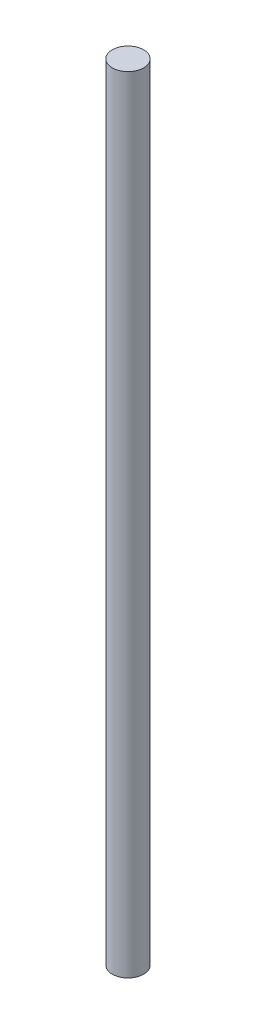
ISO-10303-21;
HEADER;
FILE_DESCRIPTION(('STEP AP214'),'2;1');
FILE_NAME('part.step','',(''),(''),'','','');
FILE_SCHEMA(('AUTOMOTIVE_DESIGN { 1 0 10303 214 1 1 1 1 }'));
ENDSEC;
DATA;
#1=APPLICATION_CONTEXT('core data for automotive mechanical design processes');
#2=APPLICATION_PROTOCOL_DEFINITION('international standard','automotive_design',2000,#1);
#3=PRODUCT_CONTEXT('',#1,'mechanical');
#4=PRODUCT('Part','Part','',(#3));
#5=PRODUCT_RELATED_PRODUCT_CATEGORY('part','',(#4));
#6=PRODUCT_DEFINITION_FORMATION('','',#4);
#7=PRODUCT_DEFINITION_CONTEXT('part definition',#1,'design');
#8=PRODUCT_DEFINITION('design','',#6,#7);
#9=PRODUCT_DEFINITION_SHAPE('','',#8);
#10=(LENGTH_UNIT() NAMED_UNIT(*) SI_UNIT(.MILLI.,.METRE.));
#11=(NAMED_UNIT(*) PLANE_ANGLE_UNIT() SI_UNIT($,.RADIAN.));
#12=(NAMED_UNIT(*) SI_UNIT($,.STERADIAN.) SOLID_ANGLE_UNIT());
#13=UNCERTAINTY_MEASURE_WITH_UNIT(LENGTH_MEASURE(1.E-05),#10,'distance_accuracy_value','');
#14=(GEOMETRIC_REPRESENTATION_CONTEXT(3) GLOBAL_UNCERTAINTY_ASSIGNED_CONTEXT((#13)) GLOBAL_UNIT_ASSIGNED_CONTEXT((#10,
#11,#12)) REPRESENTATION_CONTEXT('',''));
#15=CARTESIAN_POINT('',(0.,0.,0.));
#16=DIRECTION('',(0.,0.,1.));
#17=DIRECTION('',(1.,0.,0.));
#18=AXIS2_PLACEMENT_3D('',#15,#16,#17);
#19=CARTESIAN_POINT('',(0.,200.,0.));
#20=DIRECTION('',(0.,-1.,0.));
#21=DIRECTION('',(0.,0.,-1.));
#22=AXIS2_PLACEMENT_3D('',#19,#20,#21);
#23=CYLINDRICAL_SURFACE('',#22,4.);
#24=CARTESIAN_POINT('',(0.,200.,0.));
#25=DIRECTION('',(0.,1.,0.));
#26=DIRECTION('',(0.,0.,1.));
#27=AXIS2_PLACEMENT_3D('',#24,#25,#26);
#28=CIRCLE('',#27,4.);
#29=CARTESIAN_POINT('',(0.,200.,4.));
#30=VERTEX_POINT('',#29);
#31=EDGE_CURVE('E10',#30,#30,#28,.T.);
#32=ORIENTED_EDGE('',*,*,#31,.F.);
#33=EDGE_LOOP('',(#32));
#34=FACE_BOUND('',#33,.T.);
#35=CARTESIAN_POINT('',(0.,0.,0.));
#36=DIRECTION('',(0.,1.,0.));
#37=DIRECTION('',(0.,0.,1.));
#38=AXIS2_PLACEMENT_3D('',#35,#36,#37);
#39=CIRCLE('',#38,4.);
#40=CARTESIAN_POINT('',(0.,0.,4.));
#41=VERTEX_POINT('',#40);
#42=EDGE_CURVE('E39',#41,#41,#39,.T.);
#43=ORIENTED_EDGE('',*,*,#42,.T.);
#44=EDGE_LOOP('',(#43));
#45=FACE_BOUND('',#44,.T.);
#46=ADVANCED_FACE('F36',(#34,#45),#23,.T.);
#47=CARTESIAN_POINT('',(0.,200.,0.));
#48=DIRECTION('',(0.,1.,0.));
#49=DIRECTION('',(0.,0.,1.));
#50=AXIS2_PLACEMENT_3D('',#47,#48,#49);
#51=PLANE('',#50);
#52=ORIENTED_EDGE('',*,*,#31,.T.);
#53=EDGE_LOOP('',(#52));
#54=FACE_BOUND('',#53,.T.);
#55=ADVANCED_FACE('F51',(#54),#51,.T.);
#56=CARTESIAN_POINT('',(0.,0.,0.));
#57=DIRECTION('',(0.,1.,0.));
#58=DIRECTION('',(0.,0.,1.));
#59=AXIS2_PLACEMENT_3D('',#56,#57,#58);
#60=PLANE('',#59);
#61=ORIENTED_EDGE('',*,*,#42,.F.);
#62=EDGE_LOOP('',(#61));
#63=FACE_BOUND('',#62,.T.);
#64=ADVANCED_FACE('F49',(#63),#60,.F.);
#65=CLOSED_SHELL('',(#46,#55,#64));
#66=MANIFOLD_SOLID_BREP('B2',#65);
#67=ADVANCED_BREP_SHAPE_REPRESENTATION('',(#18,#66),#14);
#68=SHAPE_DEFINITION_REPRESENTATION(#9,#67);
ENDSEC;
END-ISO-10303-21;
